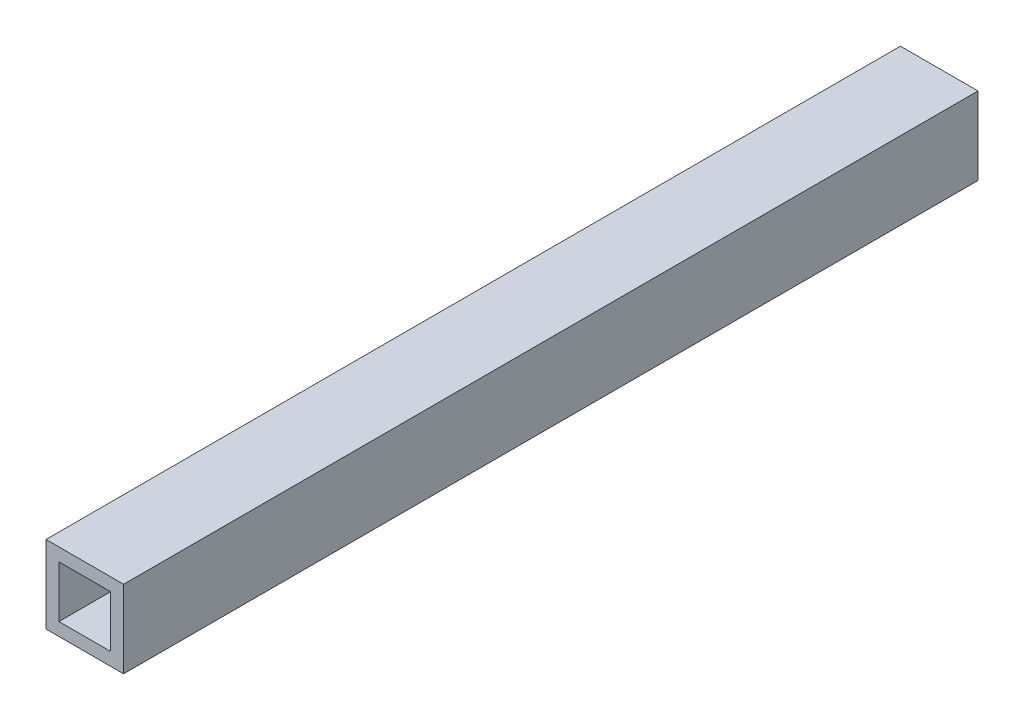
ISO-10303-21;
HEADER;
FILE_DESCRIPTION(('STEP AP214'),'2;1');
FILE_NAME('part.step','',(''),(''),'','','');
FILE_SCHEMA(('AUTOMOTIVE_DESIGN { 1 0 10303 214 1 1 1 1 }'));
ENDSEC;
DATA;
#1=APPLICATION_CONTEXT('core data for automotive mechanical design processes');
#2=APPLICATION_PROTOCOL_DEFINITION('international standard','automotive_design',2000,#1);
#3=PRODUCT_CONTEXT('',#1,'mechanical');
#4=PRODUCT('Part','Part','',(#3));
#5=PRODUCT_RELATED_PRODUCT_CATEGORY('part','',(#4));
#6=PRODUCT_DEFINITION_FORMATION('','',#4);
#7=PRODUCT_DEFINITION_CONTEXT('part definition',#1,'design');
#8=PRODUCT_DEFINITION('design','',#6,#7);
#9=PRODUCT_DEFINITION_SHAPE('','',#8);
#10=(LENGTH_UNIT() NAMED_UNIT(*) SI_UNIT(.MILLI.,.METRE.));
#11=(NAMED_UNIT(*) PLANE_ANGLE_UNIT() SI_UNIT($,.RADIAN.));
#12=(NAMED_UNIT(*) SI_UNIT($,.STERADIAN.) SOLID_ANGLE_UNIT());
#13=UNCERTAINTY_MEASURE_WITH_UNIT(LENGTH_MEASURE(1.E-05),#10,'distance_accuracy_value','');
#14=(GEOMETRIC_REPRESENTATION_CONTEXT(3) GLOBAL_UNCERTAINTY_ASSIGNED_CONTEXT((#13)) GLOBAL_UNIT_ASSIGNED_CONTEXT((#10,
#11,#12)) REPRESENTATION_CONTEXT('',''));
#15=CARTESIAN_POINT('',(0.,0.,0.));
#16=DIRECTION('',(0.,0.,1.));
#17=DIRECTION('',(1.,0.,0.));
#18=AXIS2_PLACEMENT_3D('',#15,#16,#17);
#19=CARTESIAN_POINT('',(-10.0134615384615,5.57660256410257,209.804));
#20=DIRECTION('',(1.,0.,0.));
#21=DIRECTION('',(0.,0.,-1.));
#22=AXIS2_PLACEMENT_3D('',#19,#20,#21);
#23=PLANE('',#22);
#24=DIRECTION('',(0.,-1.,0.));
#25=VECTOR('',#24,1.);
#26=CARTESIAN_POINT('',(-10.0134615384615,5.57660256410257,0.));
#27=LINE('',#26,#25);
#28=CARTESIAN_POINT('',(-10.0134615384615,5.57660256410257,0.));
#29=VERTEX_POINT('',#28);
#30=CARTESIAN_POINT('',(-10.0134615384615,-13.4733974358974,0.));
#31=VERTEX_POINT('',#30);
#32=EDGE_CURVE('E130',#29,#31,#27,.T.);
#33=ORIENTED_EDGE('',*,*,#32,.T.);
#34=DIRECTION('',(0.,0.,-1.));
#35=VECTOR('',#34,1.);
#36=CARTESIAN_POINT('',(-10.0134615384615,-13.4733974358974,209.804));
#37=LINE('',#36,#35);
#38=CARTESIAN_POINT('',(-10.0134615384615,-13.4733974358974,209.804));
#39=VERTEX_POINT('',#38);
#40=EDGE_CURVE('E11',#39,#31,#37,.T.);
#41=ORIENTED_EDGE('',*,*,#40,.F.);
#42=DIRECTION('',(0.,-1.,0.));
#43=VECTOR('',#42,1.);
#44=CARTESIAN_POINT('',(-10.0134615384615,5.57660256410257,209.804));
#45=LINE('',#44,#43);
#46=CARTESIAN_POINT('',(-10.0134615384615,5.57660256410257,209.804));
#47=VERTEX_POINT('',#46);
#48=EDGE_CURVE('E134',#47,#39,#45,.T.);
#49=ORIENTED_EDGE('',*,*,#48,.F.);
#50=DIRECTION('',(0.,0.,-1.));
#51=VECTOR('',#50,1.);
#52=CARTESIAN_POINT('',(-10.0134615384615,5.57660256410257,209.804));
#53=LINE('',#52,#51);
#54=EDGE_CURVE('E144',#47,#29,#53,.T.);
#55=ORIENTED_EDGE('',*,*,#54,.T.);
#56=EDGE_LOOP('',(#33,#41,#49,#55));
#57=FACE_BOUND('',#56,.T.);
#58=ADVANCED_FACE('F33',(#57),#23,.F.);
#59=CARTESIAN_POINT('',(-10.0134615384615,-13.4733974358974,209.804));
#60=DIRECTION('',(0.,1.,0.));
#61=DIRECTION('',(0.,0.,1.));
#62=AXIS2_PLACEMENT_3D('',#59,#60,#61);
#63=PLANE('',#62);
#64=DIRECTION('',(1.,0.,0.));
#65=VECTOR('',#64,1.);
#66=CARTESIAN_POINT('',(-10.0134615384615,-13.4733974358974,0.));
#67=LINE('',#66,#65);
#68=CARTESIAN_POINT('',(9.03653846153846,-13.4733974358974,0.));
#69=VERTEX_POINT('',#68);
#70=EDGE_CURVE('E147',#31,#69,#67,.T.);
#71=ORIENTED_EDGE('',*,*,#70,.T.);
#72=DIRECTION('',(0.,0.,-1.));
#73=VECTOR('',#72,1.);
#74=CARTESIAN_POINT('',(9.03653846153846,-13.4733974358974,209.804));
#75=LINE('',#74,#73);
#76=CARTESIAN_POINT('',(9.03653846153846,-13.4733974358974,209.804));
#77=VERTEX_POINT('',#76);
#78=EDGE_CURVE('E40',#77,#69,#75,.T.);
#79=ORIENTED_EDGE('',*,*,#78,.F.);
#80=DIRECTION('',(1.,0.,0.));
#81=VECTOR('',#80,1.);
#82=CARTESIAN_POINT('',(-10.0134615384615,-13.4733974358974,209.804));
#83=LINE('',#82,#81);
#84=EDGE_CURVE('E137',#39,#77,#83,.T.);
#85=ORIENTED_EDGE('',*,*,#84,.F.);
#86=ORIENTED_EDGE('',*,*,#40,.T.);
#87=EDGE_LOOP('',(#71,#79,#85,#86));
#88=FACE_BOUND('',#87,.T.);
#89=ADVANCED_FACE('F175',(#88),#63,.F.);
#90=CARTESIAN_POINT('',(9.03653846153845,5.57660256410257,209.804));
#91=DIRECTION('',(-1.,0.,0.));
#92=DIRECTION('',(0.,-1.,0.));
#93=AXIS2_PLACEMENT_3D('',#90,#91,#92);
#94=PLANE('',#93);
#95=DIRECTION('',(0.,1.,0.));
#96=VECTOR('',#95,1.);
#97=CARTESIAN_POINT('',(9.03653846153845,5.57660256410257,0.));
#98=LINE('',#97,#96);
#99=CARTESIAN_POINT('',(9.03653846153845,5.57660256410257,0.));
#100=VERTEX_POINT('',#99);
#101=EDGE_CURVE('E149',#69,#100,#98,.T.);
#102=ORIENTED_EDGE('',*,*,#101,.T.);
#103=DIRECTION('',(0.,0.,-1.));
#104=VECTOR('',#103,1.);
#105=CARTESIAN_POINT('',(9.03653846153845,5.57660256410257,209.804));
#106=LINE('',#105,#104);
#107=CARTESIAN_POINT('',(9.03653846153845,5.57660256410257,209.804));
#108=VERTEX_POINT('',#107);
#109=EDGE_CURVE('E154',#108,#100,#106,.T.);
#110=ORIENTED_EDGE('',*,*,#109,.F.);
#111=DIRECTION('',(0.,1.,0.));
#112=VECTOR('',#111,1.);
#113=CARTESIAN_POINT('',(9.03653846153845,5.57660256410257,209.804));
#114=LINE('',#113,#112);
#115=EDGE_CURVE('E140',#77,#108,#114,.T.);
#116=ORIENTED_EDGE('',*,*,#115,.F.);
#117=ORIENTED_EDGE('',*,*,#78,.T.);
#118=EDGE_LOOP('',(#102,#110,#116,#117));
#119=FACE_BOUND('',#118,.T.);
#120=ADVANCED_FACE('F161',(#119),#94,.F.);
#121=CARTESIAN_POINT('',(-10.0134615384615,5.57660256410257,209.804));
#122=DIRECTION('',(0.,-1.,0.));
#123=DIRECTION('',(0.,0.,-1.));
#124=AXIS2_PLACEMENT_3D('',#121,#122,#123);
#125=PLANE('',#124);
#126=DIRECTION('',(-1.,0.,0.));
#127=VECTOR('',#126,1.);
#128=CARTESIAN_POINT('',(-10.0134615384615,5.57660256410257,0.));
#129=LINE('',#128,#127);
#130=EDGE_CURVE('E138',#100,#29,#129,.T.);
#131=ORIENTED_EDGE('',*,*,#130,.T.);
#132=ORIENTED_EDGE('',*,*,#54,.F.);
#133=DIRECTION('',(-1.,0.,0.));
#134=VECTOR('',#133,1.);
#135=CARTESIAN_POINT('',(-10.0134615384615,5.57660256410257,209.804));
#136=LINE('',#135,#134);
#137=EDGE_CURVE('E142',#108,#47,#136,.T.);
#138=ORIENTED_EDGE('',*,*,#137,.F.);
#139=ORIENTED_EDGE('',*,*,#109,.T.);
#140=EDGE_LOOP('',(#131,#132,#138,#139));
#141=FACE_BOUND('',#140,.T.);
#142=ADVANCED_FACE('F170',(#141),#125,.F.);
#143=CARTESIAN_POINT('',(0.,0.,209.804));
#144=DIRECTION('',(0.,0.,1.));
#145=DIRECTION('',(1.,0.,0.));
#146=AXIS2_PLACEMENT_3D('',#143,#144,#145);
#147=PLANE('',#146);
#148=DIRECTION('',(-1.,0.,0.));
#149=VECTOR('',#148,1.);
#150=CARTESIAN_POINT('',(5.86153846153846,-10.2983974358974,209.804));
#151=LINE('',#150,#149);
#152=CARTESIAN_POINT('',(5.86153846153846,-10.2983974358974,209.804));
#153=VERTEX_POINT('',#152);
#154=CARTESIAN_POINT('',(-6.83846153846155,-10.2983974358974,209.804));
#155=VERTEX_POINT('',#154);
#156=EDGE_CURVE('E99',#153,#155,#151,.T.);
#157=ORIENTED_EDGE('',*,*,#156,.T.);
#158=DIRECTION('',(0.,1.,0.));
#159=VECTOR('',#158,1.);
#160=CARTESIAN_POINT('',(-6.83846153846155,-10.2983974358974,209.804));
#161=LINE('',#160,#159);
#162=CARTESIAN_POINT('',(-6.83846153846155,2.40160256410257,209.804));
#163=VERTEX_POINT('',#162);
#164=EDGE_CURVE('E108',#155,#163,#161,.T.);
#165=ORIENTED_EDGE('',*,*,#164,.T.);
#166=DIRECTION('',(1.,0.,0.));
#167=VECTOR('',#166,1.);
#168=CARTESIAN_POINT('',(-6.83846153846155,2.40160256410257,209.804));
#169=LINE('',#168,#167);
#170=CARTESIAN_POINT('',(5.86153846153845,2.40160256410257,209.804));
#171=VERTEX_POINT('',#170);
#172=EDGE_CURVE('E47',#163,#171,#169,.T.);
#173=ORIENTED_EDGE('',*,*,#172,.T.);
#174=DIRECTION('',(0.,-1.,0.));
#175=VECTOR('',#174,1.);
#176=CARTESIAN_POINT('',(5.86153846153845,2.40160256410257,209.804));
#177=LINE('',#176,#175);
#178=EDGE_CURVE('E105',#171,#153,#177,.T.);
#179=ORIENTED_EDGE('',*,*,#178,.T.);
#180=EDGE_LOOP('',(#157,#165,#173,#179));
#181=FACE_BOUND('',#180,.T.);
#182=ORIENTED_EDGE('',*,*,#48,.T.);
#183=ORIENTED_EDGE('',*,*,#84,.T.);
#184=ORIENTED_EDGE('',*,*,#115,.T.);
#185=ORIENTED_EDGE('',*,*,#137,.T.);
#186=EDGE_LOOP('',(#182,#183,#184,#185));
#187=FACE_BOUND('',#186,.T.);
#188=ADVANCED_FACE('F112',(#181,#187),#147,.T.);
#189=CARTESIAN_POINT('',(0.,0.,0.));
#190=DIRECTION('',(0.,0.,1.));
#191=DIRECTION('',(1.,0.,0.));
#192=AXIS2_PLACEMENT_3D('',#189,#190,#191);
#193=PLANE('',#192);
#194=DIRECTION('',(0.,1.,0.));
#195=VECTOR('',#194,1.);
#196=CARTESIAN_POINT('',(-6.83846153846155,-10.2983974358974,0.));
#197=LINE('',#196,#195);
#198=CARTESIAN_POINT('',(-6.83846153846155,-10.2983974358974,0.));
#199=VERTEX_POINT('',#198);
#200=CARTESIAN_POINT('',(-6.83846153846155,2.40160256410257,0.));
#201=VERTEX_POINT('',#200);
#202=EDGE_CURVE('E124',#199,#201,#197,.T.);
#203=ORIENTED_EDGE('',*,*,#202,.F.);
#204=DIRECTION('',(-1.,0.,0.));
#205=VECTOR('',#204,1.);
#206=CARTESIAN_POINT('',(5.86153846153846,-10.2983974358974,0.));
#207=LINE('',#206,#205);
#208=CARTESIAN_POINT('',(5.86153846153846,-10.2983974358974,0.));
#209=VERTEX_POINT('',#208);
#210=EDGE_CURVE('E55',#209,#199,#207,.T.);
#211=ORIENTED_EDGE('',*,*,#210,.F.);
#212=DIRECTION('',(0.,-1.,0.));
#213=VECTOR('',#212,1.);
#214=CARTESIAN_POINT('',(5.86153846153845,2.40160256410257,0.));
#215=LINE('',#214,#213);
#216=CARTESIAN_POINT('',(5.86153846153845,2.40160256410257,0.));
#217=VERTEX_POINT('',#216);
#218=EDGE_CURVE('E115',#217,#209,#215,.T.);
#219=ORIENTED_EDGE('',*,*,#218,.F.);
#220=DIRECTION('',(1.,0.,0.));
#221=VECTOR('',#220,1.);
#222=CARTESIAN_POINT('',(-6.83846153846155,2.40160256410257,0.));
#223=LINE('',#222,#221);
#224=EDGE_CURVE('E118',#201,#217,#223,.T.);
#225=ORIENTED_EDGE('',*,*,#224,.F.);
#226=EDGE_LOOP('',(#203,#211,#219,#225));
#227=FACE_BOUND('',#226,.T.);
#228=ORIENTED_EDGE('',*,*,#32,.F.);
#229=ORIENTED_EDGE('',*,*,#130,.F.);
#230=ORIENTED_EDGE('',*,*,#101,.F.);
#231=ORIENTED_EDGE('',*,*,#70,.F.);
#232=EDGE_LOOP('',(#228,#229,#230,#231));
#233=FACE_BOUND('',#232,.T.);
#234=ADVANCED_FACE('F167',(#227,#233),#193,.F.);
#235=CARTESIAN_POINT('',(5.86153846153846,-10.2983974358974,209.804));
#236=DIRECTION('',(0.,-1.,0.));
#237=DIRECTION('',(0.,0.,-1.));
#238=AXIS2_PLACEMENT_3D('',#235,#236,#237);
#239=PLANE('',#238);
#240=ORIENTED_EDGE('',*,*,#210,.T.);
#241=DIRECTION('',(0.,0.,-1.));
#242=VECTOR('',#241,1.);
#243=CARTESIAN_POINT('',(-6.83846153846155,-10.2983974358974,209.804));
#244=LINE('',#243,#242);
#245=EDGE_CURVE('E95',#155,#199,#244,.T.);
#246=ORIENTED_EDGE('',*,*,#245,.F.);
#247=ORIENTED_EDGE('',*,*,#156,.F.);
#248=DIRECTION('',(0.,0.,-1.));
#249=VECTOR('',#248,1.);
#250=CARTESIAN_POINT('',(5.86153846153846,-10.2983974358974,209.804));
#251=LINE('',#250,#249);
#252=EDGE_CURVE('E128',#153,#209,#251,.T.);
#253=ORIENTED_EDGE('',*,*,#252,.T.);
#254=EDGE_LOOP('',(#240,#246,#247,#253));
#255=FACE_BOUND('',#254,.T.);
#256=ADVANCED_FACE('F97',(#255),#239,.F.);
#257=CARTESIAN_POINT('',(5.86153846153845,2.40160256410257,209.804));
#258=DIRECTION('',(1.,0.,0.));
#259=DIRECTION('',(0.,1.,0.));
#260=AXIS2_PLACEMENT_3D('',#257,#258,#259);
#261=PLANE('',#260);
#262=ORIENTED_EDGE('',*,*,#218,.T.);
#263=ORIENTED_EDGE('',*,*,#252,.F.);
#264=ORIENTED_EDGE('',*,*,#178,.F.);
#265=DIRECTION('',(0.,0.,-1.));
#266=VECTOR('',#265,1.);
#267=CARTESIAN_POINT('',(5.86153846153845,2.40160256410257,209.804));
#268=LINE('',#267,#266);
#269=EDGE_CURVE('E131',#171,#217,#268,.T.);
#270=ORIENTED_EDGE('',*,*,#269,.T.);
#271=EDGE_LOOP('',(#262,#263,#264,#270));
#272=FACE_BOUND('',#271,.T.);
#273=ADVANCED_FACE('F192',(#272),#261,.F.);
#274=CARTESIAN_POINT('',(-6.83846153846155,2.40160256410257,209.804));
#275=DIRECTION('',(0.,1.,0.));
#276=DIRECTION('',(0.,0.,1.));
#277=AXIS2_PLACEMENT_3D('',#274,#275,#276);
#278=PLANE('',#277);
#279=ORIENTED_EDGE('',*,*,#224,.T.);
#280=ORIENTED_EDGE('',*,*,#269,.F.);
#281=ORIENTED_EDGE('',*,*,#172,.F.);
#282=DIRECTION('',(0.,0.,-1.));
#283=VECTOR('',#282,1.);
#284=CARTESIAN_POINT('',(-6.83846153846155,2.40160256410257,209.804));
#285=LINE('',#284,#283);
#286=EDGE_CURVE('E104',#163,#201,#285,.T.);
#287=ORIENTED_EDGE('',*,*,#286,.T.);
#288=EDGE_LOOP('',(#279,#280,#281,#287));
#289=FACE_BOUND('',#288,.T.);
#290=ADVANCED_FACE('F195',(#289),#278,.F.);
#291=CARTESIAN_POINT('',(-6.83846153846155,-10.2983974358974,209.804));
#292=DIRECTION('',(-1.,0.,0.));
#293=DIRECTION('',(0.,0.,1.));
#294=AXIS2_PLACEMENT_3D('',#291,#292,#293);
#295=PLANE('',#294);
#296=ORIENTED_EDGE('',*,*,#202,.T.);
#297=ORIENTED_EDGE('',*,*,#286,.F.);
#298=ORIENTED_EDGE('',*,*,#164,.F.);
#299=ORIENTED_EDGE('',*,*,#245,.T.);
#300=EDGE_LOOP('',(#296,#297,#298,#299));
#301=FACE_BOUND('',#300,.T.);
#302=ADVANCED_FACE('F109',(#301),#295,.F.);
#303=CLOSED_SHELL('',(#58,#89,#120,#142,#188,#234,#256,#273,#290,#302));
#304=MANIFOLD_SOLID_BREP('B2',#303);
#305=ADVANCED_BREP_SHAPE_REPRESENTATION('',(#18,#304),#14);
#306=SHAPE_DEFINITION_REPRESENTATION(#9,#305);
ENDSEC;
END-ISO-10303-21;
